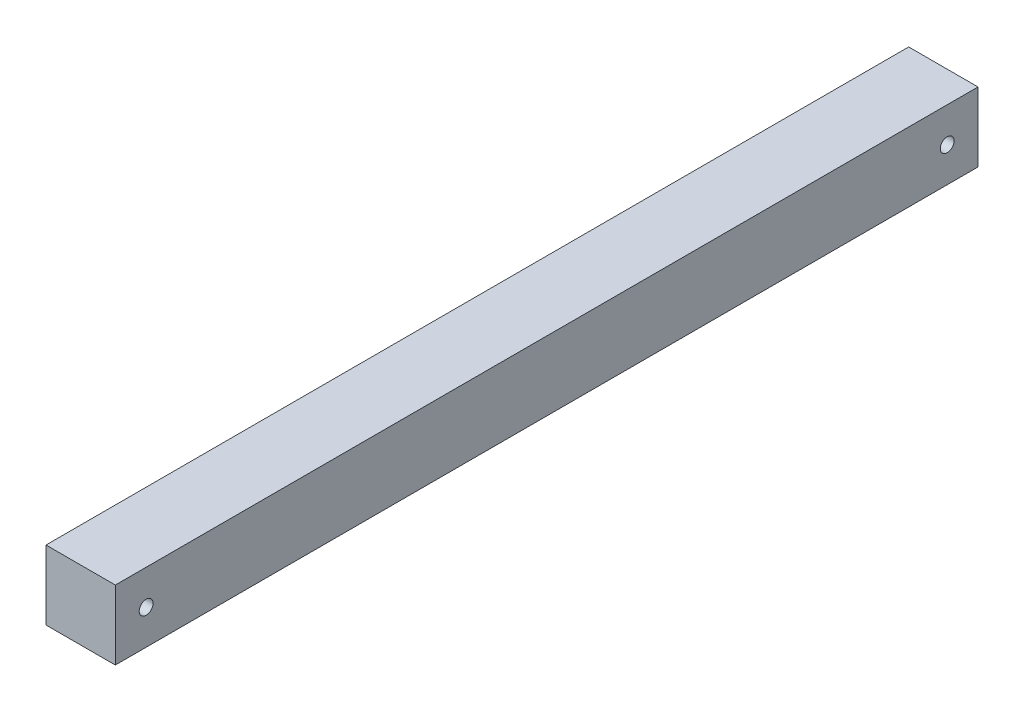
ISO-10303-21;
HEADER;
FILE_DESCRIPTION(('STEP AP214'),'2;1');
FILE_NAME('part.step','',(''),(''),'','','');
FILE_SCHEMA(('AUTOMOTIVE_DESIGN { 1 0 10303 214 1 1 1 1 }'));
ENDSEC;
DATA;
#1=APPLICATION_CONTEXT('core data for automotive mechanical design processes');
#2=APPLICATION_PROTOCOL_DEFINITION('international standard','automotive_design',2000,#1);
#3=PRODUCT_CONTEXT('',#1,'mechanical');
#4=PRODUCT('Part','Part','',(#3));
#5=PRODUCT_RELATED_PRODUCT_CATEGORY('part','',(#4));
#6=PRODUCT_DEFINITION_FORMATION('','',#4);
#7=PRODUCT_DEFINITION_CONTEXT('part definition',#1,'design');
#8=PRODUCT_DEFINITION('design','',#6,#7);
#9=PRODUCT_DEFINITION_SHAPE('','',#8);
#10=(LENGTH_UNIT() NAMED_UNIT(*) SI_UNIT(.MILLI.,.METRE.));
#11=(NAMED_UNIT(*) PLANE_ANGLE_UNIT() SI_UNIT($,.RADIAN.));
#12=(NAMED_UNIT(*) SI_UNIT($,.STERADIAN.) SOLID_ANGLE_UNIT());
#13=UNCERTAINTY_MEASURE_WITH_UNIT(LENGTH_MEASURE(1.E-05),#10,'distance_accuracy_value','');
#14=(GEOMETRIC_REPRESENTATION_CONTEXT(3) GLOBAL_UNCERTAINTY_ASSIGNED_CONTEXT((#13)) GLOBAL_UNIT_ASSIGNED_CONTEXT((#10,
#11,#12)) REPRESENTATION_CONTEXT('',''));
#15=CARTESIAN_POINT('',(0.,0.,0.));
#16=DIRECTION('',(0.,0.,1.));
#17=DIRECTION('',(1.,0.,0.));
#18=AXIS2_PLACEMENT_3D('',#15,#16,#17);
#19=CARTESIAN_POINT('',(-27.990565008726,19.1426701570681,280.));
#20=DIRECTION('',(1.,0.,0.));
#21=DIRECTION('',(0.,0.,-1.));
#22=AXIS2_PLACEMENT_3D('',#19,#20,#21);
#23=PLANE('',#22);
#24=CARTESIAN_POINT('',(-27.990565008726,7.89267015706806,270.));
#25=DIRECTION('',(1.,0.,0.));
#26=DIRECTION('',(0.,0.,-1.));
#27=AXIS2_PLACEMENT_3D('',#24,#25,#26);
#28=CIRCLE('',#27,2.24999999999995);
#29=CARTESIAN_POINT('',(-27.990565008726,7.89267015706806,267.75));
#30=VERTEX_POINT('',#29);
#31=EDGE_CURVE('E111',#30,#30,#28,.F.);
#32=ORIENTED_EDGE('',*,*,#31,.F.);
#33=EDGE_LOOP('',(#32));
#34=FACE_BOUND('',#33,.T.);
#35=CARTESIAN_POINT('',(-27.990565008726,7.89267015706806,10.));
#36=DIRECTION('',(1.,0.,0.));
#37=DIRECTION('',(0.,0.,-1.));
#38=AXIS2_PLACEMENT_3D('',#35,#36,#37);
#39=CIRCLE('',#38,2.25);
#40=CARTESIAN_POINT('',(-27.990565008726,7.89267015706806,7.75));
#41=VERTEX_POINT('',#40);
#42=EDGE_CURVE('E128',#41,#41,#39,.F.);
#43=ORIENTED_EDGE('',*,*,#42,.F.);
#44=EDGE_LOOP('',(#43));
#45=FACE_BOUND('',#44,.T.);
#46=DIRECTION('',(0.,-1.,0.));
#47=VECTOR('',#46,1.);
#48=CARTESIAN_POINT('',(-27.990565008726,19.1426701570681,0.));
#49=LINE('',#48,#47);
#50=CARTESIAN_POINT('',(-27.990565008726,19.1426701570681,0.));
#51=VERTEX_POINT('',#50);
#52=CARTESIAN_POINT('',(-27.990565008726,-3.35732984293194,0.));
#53=VERTEX_POINT('',#52);
#54=EDGE_CURVE('E107',#51,#53,#49,.T.);
#55=ORIENTED_EDGE('',*,*,#54,.T.);
#56=DIRECTION('',(0.,0.,-1.));
#57=VECTOR('',#56,1.);
#58=CARTESIAN_POINT('',(-27.990565008726,-3.35732984293194,280.));
#59=LINE('',#58,#57);
#60=CARTESIAN_POINT('',(-27.990565008726,-3.35732984293194,280.));
#61=VERTEX_POINT('',#60);
#62=EDGE_CURVE('E11',#61,#53,#59,.T.);
#63=ORIENTED_EDGE('',*,*,#62,.F.);
#64=DIRECTION('',(0.,-1.,0.));
#65=VECTOR('',#64,1.);
#66=CARTESIAN_POINT('',(-27.990565008726,19.1426701570681,280.));
#67=LINE('',#66,#65);
#68=CARTESIAN_POINT('',(-27.990565008726,19.1426701570681,280.));
#69=VERTEX_POINT('',#68);
#70=EDGE_CURVE('E91',#69,#61,#67,.T.);
#71=ORIENTED_EDGE('',*,*,#70,.F.);
#72=DIRECTION('',(0.,0.,-1.));
#73=VECTOR('',#72,1.);
#74=CARTESIAN_POINT('',(-27.990565008726,19.1426701570681,280.));
#75=LINE('',#74,#73);
#76=EDGE_CURVE('E103',#69,#51,#75,.T.);
#77=ORIENTED_EDGE('',*,*,#76,.T.);
#78=EDGE_LOOP('',(#55,#63,#71,#77));
#79=FACE_BOUND('',#78,.T.);
#80=ADVANCED_FACE('F39',(#34,#45,#79),#23,.F.);
#81=CARTESIAN_POINT('',(-27.990565008726,-3.35732984293194,280.));
#82=DIRECTION('',(0.,1.,0.));
#83=DIRECTION('',(0.,0.,1.));
#84=AXIS2_PLACEMENT_3D('',#81,#82,#83);
#85=PLANE('',#84);
#86=DIRECTION('',(1.,0.,0.));
#87=VECTOR('',#86,1.);
#88=CARTESIAN_POINT('',(-27.990565008726,-3.35732984293194,0.));
#89=LINE('',#88,#87);
#90=CARTESIAN_POINT('',(-5.490565008726,-3.35732984293194,0.));
#91=VERTEX_POINT('',#90);
#92=EDGE_CURVE('E96',#53,#91,#89,.T.);
#93=ORIENTED_EDGE('',*,*,#92,.T.);
#94=DIRECTION('',(0.,0.,-1.));
#95=VECTOR('',#94,1.);
#96=CARTESIAN_POINT('',(-5.490565008726,-3.35732984293194,280.));
#97=LINE('',#96,#95);
#98=CARTESIAN_POINT('',(-5.490565008726,-3.35732984293194,280.));
#99=VERTEX_POINT('',#98);
#100=EDGE_CURVE('E48',#99,#91,#97,.T.);
#101=ORIENTED_EDGE('',*,*,#100,.F.);
#102=DIRECTION('',(1.,0.,0.));
#103=VECTOR('',#102,1.);
#104=CARTESIAN_POINT('',(-27.990565008726,-3.35732984293194,280.));
#105=LINE('',#104,#103);
#106=EDGE_CURVE('E86',#61,#99,#105,.T.);
#107=ORIENTED_EDGE('',*,*,#106,.F.);
#108=ORIENTED_EDGE('',*,*,#62,.T.);
#109=EDGE_LOOP('',(#93,#101,#107,#108));
#110=FACE_BOUND('',#109,.T.);
#111=ADVANCED_FACE('F95',(#110),#85,.F.);
#112=CARTESIAN_POINT('',(-5.490565008726,19.1426701570681,280.));
#113=DIRECTION('',(-1.,0.,0.));
#114=DIRECTION('',(0.,-1.,0.));
#115=AXIS2_PLACEMENT_3D('',#112,#113,#114);
#116=PLANE('',#115);
#117=CARTESIAN_POINT('',(-5.490565008726,7.89267015706806,270.));
#118=DIRECTION('',(1.,0.,0.));
#119=DIRECTION('',(0.,1.,0.));
#120=AXIS2_PLACEMENT_3D('',#117,#118,#119);
#121=CIRCLE('',#120,2.24999999999995);
#122=CARTESIAN_POINT('',(-5.490565008726,10.142670157068,270.));
#123=VERTEX_POINT('',#122);
#124=EDGE_CURVE('E132',#123,#123,#121,.T.);
#125=ORIENTED_EDGE('',*,*,#124,.F.);
#126=EDGE_LOOP('',(#125));
#127=FACE_BOUND('',#126,.T.);
#128=CARTESIAN_POINT('',(-5.490565008726,7.89267015706806,10.));
#129=DIRECTION('',(1.,0.,0.));
#130=DIRECTION('',(0.,1.,0.));
#131=AXIS2_PLACEMENT_3D('',#128,#129,#130);
#132=CIRCLE('',#131,2.25);
#133=CARTESIAN_POINT('',(-5.490565008726,10.1426701570681,10.));
#134=VERTEX_POINT('',#133);
#135=EDGE_CURVE('E133',#134,#134,#132,.T.);
#136=ORIENTED_EDGE('',*,*,#135,.F.);
#137=EDGE_LOOP('',(#136));
#138=FACE_BOUND('',#137,.T.);
#139=DIRECTION('',(0.,1.,0.));
#140=VECTOR('',#139,1.);
#141=CARTESIAN_POINT('',(-5.490565008726,19.1426701570681,0.));
#142=LINE('',#141,#140);
#143=CARTESIAN_POINT('',(-5.490565008726,19.1426701570681,0.));
#144=VERTEX_POINT('',#143);
#145=EDGE_CURVE('E73',#91,#144,#142,.T.);
#146=ORIENTED_EDGE('',*,*,#145,.T.);
#147=DIRECTION('',(0.,0.,-1.));
#148=VECTOR('',#147,1.);
#149=CARTESIAN_POINT('',(-5.490565008726,19.1426701570681,280.));
#150=LINE('',#149,#148);
#151=CARTESIAN_POINT('',(-5.490565008726,19.1426701570681,280.));
#152=VERTEX_POINT('',#151);
#153=EDGE_CURVE('E98',#152,#144,#150,.T.);
#154=ORIENTED_EDGE('',*,*,#153,.F.);
#155=DIRECTION('',(0.,1.,0.));
#156=VECTOR('',#155,1.);
#157=CARTESIAN_POINT('',(-5.490565008726,19.1426701570681,280.));
#158=LINE('',#157,#156);
#159=EDGE_CURVE('E89',#99,#152,#158,.T.);
#160=ORIENTED_EDGE('',*,*,#159,.F.);
#161=ORIENTED_EDGE('',*,*,#100,.T.);
#162=EDGE_LOOP('',(#146,#154,#160,#161));
#163=FACE_BOUND('',#162,.T.);
#164=ADVANCED_FACE('F99',(#127,#138,#163),#116,.F.);
#165=CARTESIAN_POINT('',(-27.990565008726,19.1426701570681,280.));
#166=DIRECTION('',(0.,-1.,0.));
#167=DIRECTION('',(0.,0.,-1.));
#168=AXIS2_PLACEMENT_3D('',#165,#166,#167);
#169=PLANE('',#168);
#170=DIRECTION('',(-1.,0.,0.));
#171=VECTOR('',#170,1.);
#172=CARTESIAN_POINT('',(-27.990565008726,19.1426701570681,0.));
#173=LINE('',#172,#171);
#174=EDGE_CURVE('E79',#144,#51,#173,.T.);
#175=ORIENTED_EDGE('',*,*,#174,.T.);
#176=ORIENTED_EDGE('',*,*,#76,.F.);
#177=DIRECTION('',(-1.,0.,0.));
#178=VECTOR('',#177,1.);
#179=CARTESIAN_POINT('',(-27.990565008726,19.1426701570681,280.));
#180=LINE('',#179,#178);
#181=EDGE_CURVE('E56',#152,#69,#180,.T.);
#182=ORIENTED_EDGE('',*,*,#181,.F.);
#183=ORIENTED_EDGE('',*,*,#153,.T.);
#184=EDGE_LOOP('',(#175,#176,#182,#183));
#185=FACE_BOUND('',#184,.T.);
#186=ADVANCED_FACE('F121',(#185),#169,.F.);
#187=CARTESIAN_POINT('',(0.,0.,280.));
#188=DIRECTION('',(0.,0.,1.));
#189=DIRECTION('',(1.,0.,0.));
#190=AXIS2_PLACEMENT_3D('',#187,#188,#189);
#191=PLANE('',#190);
#192=ORIENTED_EDGE('',*,*,#70,.T.);
#193=ORIENTED_EDGE('',*,*,#106,.T.);
#194=ORIENTED_EDGE('',*,*,#159,.T.);
#195=ORIENTED_EDGE('',*,*,#181,.T.);
#196=EDGE_LOOP('',(#192,#193,#194,#195));
#197=FACE_BOUND('',#196,.T.);
#198=ADVANCED_FACE('F87',(#197),#191,.T.);
#199=CARTESIAN_POINT('',(0.,0.,0.));
#200=DIRECTION('',(0.,0.,1.));
#201=DIRECTION('',(1.,0.,0.));
#202=AXIS2_PLACEMENT_3D('',#199,#200,#201);
#203=PLANE('',#202);
#204=ORIENTED_EDGE('',*,*,#54,.F.);
#205=ORIENTED_EDGE('',*,*,#174,.F.);
#206=ORIENTED_EDGE('',*,*,#145,.F.);
#207=ORIENTED_EDGE('',*,*,#92,.F.);
#208=EDGE_LOOP('',(#204,#205,#206,#207));
#209=FACE_BOUND('',#208,.T.);
#210=ADVANCED_FACE('F124',(#209),#203,.F.);
#211=CARTESIAN_POINT('',(-27.991565008726,7.89267015706806,10.));
#212=DIRECTION('',(1.,0.,0.));
#213=DIRECTION('',(0.,1.,0.));
#214=AXIS2_PLACEMENT_3D('',#211,#212,#213);
#215=CYLINDRICAL_SURFACE('',#214,2.25);
#216=ORIENTED_EDGE('',*,*,#135,.T.);
#217=EDGE_LOOP('',(#216));
#218=FACE_BOUND('',#217,.T.);
#219=ORIENTED_EDGE('',*,*,#42,.T.);
#220=EDGE_LOOP('',(#219));
#221=FACE_BOUND('',#220,.T.);
#222=ADVANCED_FACE('F152',(#218,#221),#215,.F.);
#223=CARTESIAN_POINT('',(-27.991565008726,7.89267015706806,270.));
#224=DIRECTION('',(1.,0.,0.));
#225=DIRECTION('',(0.,1.,0.));
#226=AXIS2_PLACEMENT_3D('',#223,#224,#225);
#227=CYLINDRICAL_SURFACE('',#226,2.24999999999995);
#228=ORIENTED_EDGE('',*,*,#124,.T.);
#229=EDGE_LOOP('',(#228));
#230=FACE_BOUND('',#229,.T.);
#231=ORIENTED_EDGE('',*,*,#31,.T.);
#232=EDGE_LOOP('',(#231));
#233=FACE_BOUND('',#232,.T.);
#234=ADVANCED_FACE('F144',(#230,#233),#227,.F.);
#235=CLOSED_SHELL('',(#80,#111,#164,#186,#198,#210,#222,#234));
#236=MANIFOLD_SOLID_BREP('B2',#235);
#237=ADVANCED_BREP_SHAPE_REPRESENTATION('',(#18,#236),#14);
#238=SHAPE_DEFINITION_REPRESENTATION(#9,#237);
ENDSEC;
END-ISO-10303-21;
